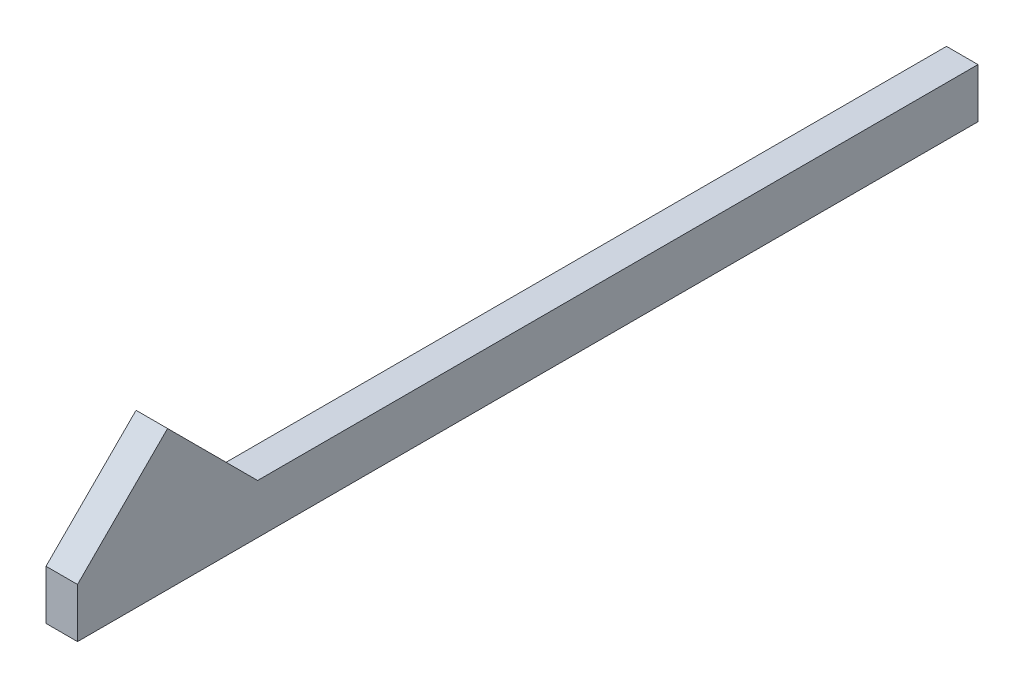
ISO-10303-21;
HEADER;
FILE_DESCRIPTION(('STEP AP214'),'2;1');
FILE_NAME('part.step','',(''),(''),'','','');
FILE_SCHEMA(('AUTOMOTIVE_DESIGN { 1 0 10303 214 1 1 1 1 }'));
ENDSEC;
DATA;
#1=APPLICATION_CONTEXT('core data for automotive mechanical design processes');
#2=APPLICATION_PROTOCOL_DEFINITION('international standard','automotive_design',2000,#1);
#3=PRODUCT_CONTEXT('',#1,'mechanical');
#4=PRODUCT('Part','Part','',(#3));
#5=PRODUCT_RELATED_PRODUCT_CATEGORY('part','',(#4));
#6=PRODUCT_DEFINITION_FORMATION('','',#4);
#7=PRODUCT_DEFINITION_CONTEXT('part definition',#1,'design');
#8=PRODUCT_DEFINITION('design','',#6,#7);
#9=PRODUCT_DEFINITION_SHAPE('','',#8);
#10=(LENGTH_UNIT() NAMED_UNIT(*) SI_UNIT(.MILLI.,.METRE.));
#11=(NAMED_UNIT(*) PLANE_ANGLE_UNIT() SI_UNIT($,.RADIAN.));
#12=(NAMED_UNIT(*) SI_UNIT($,.STERADIAN.) SOLID_ANGLE_UNIT());
#13=UNCERTAINTY_MEASURE_WITH_UNIT(LENGTH_MEASURE(1.E-05),#10,'distance_accuracy_value','');
#14=(GEOMETRIC_REPRESENTATION_CONTEXT(3) GLOBAL_UNCERTAINTY_ASSIGNED_CONTEXT((#13)) GLOBAL_UNIT_ASSIGNED_CONTEXT((#10,
#11,#12)) REPRESENTATION_CONTEXT('',''));
#15=CARTESIAN_POINT('',(0.,0.,0.));
#16=DIRECTION('',(0.,0.,1.));
#17=DIRECTION('',(1.,0.,0.));
#18=AXIS2_PLACEMENT_3D('',#15,#16,#17);
#19=CARTESIAN_POINT('',(0.,0.,-100.));
#20=DIRECTION('',(-1.,0.,0.));
#21=DIRECTION('',(0.,0.,1.));
#22=AXIS2_PLACEMENT_3D('',#19,#20,#21);
#23=PLANE('',#22);
#24=DIRECTION('',(0.,-1.,0.));
#25=VECTOR('',#24,1.);
#26=CARTESIAN_POINT('',(0.,0.,0.));
#27=LINE('',#26,#25);
#28=CARTESIAN_POINT('',(0.,5.5,0.));
#29=VERTEX_POINT('',#28);
#30=CARTESIAN_POINT('',(0.,0.,0.));
#31=VERTEX_POINT('',#30);
#32=EDGE_CURVE('E77',#29,#31,#27,.T.);
#33=ORIENTED_EDGE('',*,*,#32,.F.);
#34=DIRECTION('',(0.,0.707106781186547,-0.707106781186548));
#35=VECTOR('',#34,1.);
#36=CARTESIAN_POINT('',(0.,15.5,-10.));
#37=LINE('',#36,#35);
#38=CARTESIAN_POINT('',(0.,15.5,-10.));
#39=VERTEX_POINT('',#38);
#40=EDGE_CURVE('E116',#29,#39,#37,.T.);
#41=ORIENTED_EDGE('',*,*,#40,.T.);
#42=DIRECTION('',(0.,-0.707106781186547,-0.707106781186548));
#43=VECTOR('',#42,1.);
#44=CARTESIAN_POINT('',(0.,15.5,-10.));
#45=LINE('',#44,#43);
#46=CARTESIAN_POINT('',(0.,5.5,-20.));
#47=VERTEX_POINT('',#46);
#48=EDGE_CURVE('E100',#39,#47,#45,.T.);
#49=ORIENTED_EDGE('',*,*,#48,.T.);
#50=DIRECTION('',(0.,0.,1.));
#51=VECTOR('',#50,1.);
#52=CARTESIAN_POINT('',(0.,5.5,-100.));
#53=LINE('',#52,#51);
#54=CARTESIAN_POINT('',(0.,5.5,-100.));
#55=VERTEX_POINT('',#54);
#56=EDGE_CURVE('E11',#55,#47,#53,.T.);
#57=ORIENTED_EDGE('',*,*,#56,.F.);
#58=DIRECTION('',(0.,-1.,0.));
#59=VECTOR('',#58,1.);
#60=CARTESIAN_POINT('',(0.,0.,-100.));
#61=LINE('',#60,#59);
#62=CARTESIAN_POINT('',(0.,0.,-100.));
#63=VERTEX_POINT('',#62);
#64=EDGE_CURVE('E121',#55,#63,#61,.T.);
#65=ORIENTED_EDGE('',*,*,#64,.T.);
#66=DIRECTION('',(0.,0.,1.));
#67=VECTOR('',#66,1.);
#68=CARTESIAN_POINT('',(0.,0.,-100.));
#69=LINE('',#68,#67);
#70=EDGE_CURVE('E38',#63,#31,#69,.T.);
#71=ORIENTED_EDGE('',*,*,#70,.T.);
#72=EDGE_LOOP('',(#33,#41,#49,#57,#65,#71));
#73=FACE_BOUND('',#72,.T.);
#74=ADVANCED_FACE('F35',(#73),#23,.T.);
#75=CARTESIAN_POINT('',(0.,5.5,-100.));
#76=DIRECTION('',(0.,1.,0.));
#77=DIRECTION('',(0.,0.,1.));
#78=AXIS2_PLACEMENT_3D('',#75,#76,#77);
#79=PLANE('',#78);
#80=DIRECTION('',(-1.,0.,0.));
#81=VECTOR('',#80,1.);
#82=CARTESIAN_POINT('',(3.5,5.5,-20.));
#83=LINE('',#82,#81);
#84=CARTESIAN_POINT('',(3.5,5.5,-20.));
#85=VERTEX_POINT('',#84);
#86=EDGE_CURVE('E50',#85,#47,#83,.T.);
#87=ORIENTED_EDGE('',*,*,#86,.F.);
#88=DIRECTION('',(0.,0.,1.));
#89=VECTOR('',#88,1.);
#90=CARTESIAN_POINT('',(3.5,5.5,-100.));
#91=LINE('',#90,#89);
#92=CARTESIAN_POINT('',(3.5,5.5,-100.));
#93=VERTEX_POINT('',#92);
#94=EDGE_CURVE('E43',#93,#85,#91,.T.);
#95=ORIENTED_EDGE('',*,*,#94,.F.);
#96=DIRECTION('',(-1.,0.,0.));
#97=VECTOR('',#96,1.);
#98=CARTESIAN_POINT('',(0.,5.5,-100.));
#99=LINE('',#98,#97);
#100=EDGE_CURVE('E127',#93,#55,#99,.T.);
#101=ORIENTED_EDGE('',*,*,#100,.T.);
#102=ORIENTED_EDGE('',*,*,#56,.T.);
#103=EDGE_LOOP('',(#87,#95,#101,#102));
#104=FACE_BOUND('',#103,.T.);
#105=ADVANCED_FACE('F145',(#104),#79,.T.);
#106=CARTESIAN_POINT('',(3.5,0.,-100.));
#107=DIRECTION('',(1.,0.,0.));
#108=DIRECTION('',(0.,0.,-1.));
#109=AXIS2_PLACEMENT_3D('',#106,#107,#108);
#110=PLANE('',#109);
#111=DIRECTION('',(0.,1.,0.));
#112=VECTOR('',#111,1.);
#113=CARTESIAN_POINT('',(3.5,0.,0.));
#114=LINE('',#113,#112);
#115=CARTESIAN_POINT('',(3.5,0.,0.));
#116=VERTEX_POINT('',#115);
#117=CARTESIAN_POINT('',(3.5,5.5,0.));
#118=VERTEX_POINT('',#117);
#119=EDGE_CURVE('E134',#116,#118,#114,.T.);
#120=ORIENTED_EDGE('',*,*,#119,.F.);
#121=DIRECTION('',(0.,0.,1.));
#122=VECTOR('',#121,1.);
#123=CARTESIAN_POINT('',(3.5,0.,-100.));
#124=LINE('',#123,#122);
#125=CARTESIAN_POINT('',(3.5,0.,-100.));
#126=VERTEX_POINT('',#125);
#127=EDGE_CURVE('E137',#126,#116,#124,.T.);
#128=ORIENTED_EDGE('',*,*,#127,.F.);
#129=DIRECTION('',(0.,1.,0.));
#130=VECTOR('',#129,1.);
#131=CARTESIAN_POINT('',(3.5,0.,-100.));
#132=LINE('',#131,#130);
#133=EDGE_CURVE('E125',#126,#93,#132,.T.);
#134=ORIENTED_EDGE('',*,*,#133,.T.);
#135=ORIENTED_EDGE('',*,*,#94,.T.);
#136=DIRECTION('',(0.,-0.707106781186547,-0.707106781186548));
#137=VECTOR('',#136,1.);
#138=CARTESIAN_POINT('',(3.5,15.5,-10.));
#139=LINE('',#138,#137);
#140=CARTESIAN_POINT('',(3.5,15.5,-10.));
#141=VERTEX_POINT('',#140);
#142=EDGE_CURVE('E99',#141,#85,#139,.T.);
#143=ORIENTED_EDGE('',*,*,#142,.F.);
#144=DIRECTION('',(0.,0.707106781186547,-0.707106781186548));
#145=VECTOR('',#144,1.);
#146=CARTESIAN_POINT('',(3.5,15.5,-10.));
#147=LINE('',#146,#145);
#148=EDGE_CURVE('E109',#118,#141,#147,.T.);
#149=ORIENTED_EDGE('',*,*,#148,.F.);
#150=EDGE_LOOP('',(#120,#128,#134,#135,#143,#149));
#151=FACE_BOUND('',#150,.T.);
#152=ADVANCED_FACE('F108',(#151),#110,.T.);
#153=CARTESIAN_POINT('',(0.,0.,-100.));
#154=DIRECTION('',(0.,-1.,0.));
#155=DIRECTION('',(0.,0.,-1.));
#156=AXIS2_PLACEMENT_3D('',#153,#154,#155);
#157=PLANE('',#156);
#158=DIRECTION('',(1.,0.,0.));
#159=VECTOR('',#158,1.);
#160=CARTESIAN_POINT('',(0.,0.,0.));
#161=LINE('',#160,#159);
#162=EDGE_CURVE('E131',#31,#116,#161,.T.);
#163=ORIENTED_EDGE('',*,*,#162,.F.);
#164=ORIENTED_EDGE('',*,*,#70,.F.);
#165=DIRECTION('',(1.,0.,0.));
#166=VECTOR('',#165,1.);
#167=CARTESIAN_POINT('',(0.,0.,-100.));
#168=LINE('',#167,#166);
#169=EDGE_CURVE('E123',#63,#126,#168,.T.);
#170=ORIENTED_EDGE('',*,*,#169,.T.);
#171=ORIENTED_EDGE('',*,*,#127,.T.);
#172=EDGE_LOOP('',(#163,#164,#170,#171));
#173=FACE_BOUND('',#172,.T.);
#174=ADVANCED_FACE('F138',(#173),#157,.T.);
#175=CARTESIAN_POINT('',(0.,0.,-100.));
#176=DIRECTION('',(0.,0.,-1.));
#177=DIRECTION('',(-1.,0.,0.));
#178=AXIS2_PLACEMENT_3D('',#175,#176,#177);
#179=PLANE('',#178);
#180=ORIENTED_EDGE('',*,*,#64,.F.);
#181=ORIENTED_EDGE('',*,*,#100,.F.);
#182=ORIENTED_EDGE('',*,*,#133,.F.);
#183=ORIENTED_EDGE('',*,*,#169,.F.);
#184=EDGE_LOOP('',(#180,#181,#182,#183));
#185=FACE_BOUND('',#184,.T.);
#186=ADVANCED_FACE('F144',(#185),#179,.T.);
#187=CARTESIAN_POINT('',(0.,0.,0.));
#188=DIRECTION('',(0.,0.,-1.));
#189=DIRECTION('',(-1.,0.,0.));
#190=AXIS2_PLACEMENT_3D('',#187,#188,#189);
#191=PLANE('',#190);
#192=ORIENTED_EDGE('',*,*,#32,.T.);
#193=ORIENTED_EDGE('',*,*,#162,.T.);
#194=ORIENTED_EDGE('',*,*,#119,.T.);
#195=DIRECTION('',(-1.,0.,0.));
#196=VECTOR('',#195,1.);
#197=CARTESIAN_POINT('',(0.,5.5,0.));
#198=LINE('',#197,#196);
#199=EDGE_CURVE('E114',#118,#29,#198,.T.);
#200=ORIENTED_EDGE('',*,*,#199,.T.);
#201=EDGE_LOOP('',(#192,#193,#194,#200));
#202=FACE_BOUND('',#201,.T.);
#203=ADVANCED_FACE('F140',(#202),#191,.F.);
#204=CARTESIAN_POINT('',(3.5,15.5,-10.));
#205=DIRECTION('',(0.,0.707106781186548,0.707106781186548));
#206=DIRECTION('',(0.,-0.707106781186547,0.707106781186548));
#207=AXIS2_PLACEMENT_3D('',#204,#205,#206);
#208=PLANE('',#207);
#209=ORIENTED_EDGE('',*,*,#40,.F.);
#210=ORIENTED_EDGE('',*,*,#199,.F.);
#211=ORIENTED_EDGE('',*,*,#148,.T.);
#212=DIRECTION('',(-1.,0.,0.));
#213=VECTOR('',#212,1.);
#214=CARTESIAN_POINT('',(3.5,15.5,-10.));
#215=LINE('',#214,#213);
#216=EDGE_CURVE('E96',#141,#39,#215,.T.);
#217=ORIENTED_EDGE('',*,*,#216,.T.);
#218=EDGE_LOOP('',(#209,#210,#211,#217));
#219=FACE_BOUND('',#218,.T.);
#220=ADVANCED_FACE('F113',(#219),#208,.T.);
#221=CARTESIAN_POINT('',(3.5,15.5,-10.));
#222=DIRECTION('',(0.,0.707106781186548,-0.707106781186548));
#223=DIRECTION('',(0.,0.707106781186547,0.707106781186548));
#224=AXIS2_PLACEMENT_3D('',#221,#222,#223);
#225=PLANE('',#224);
#226=ORIENTED_EDGE('',*,*,#48,.F.);
#227=ORIENTED_EDGE('',*,*,#216,.F.);
#228=ORIENTED_EDGE('',*,*,#142,.T.);
#229=ORIENTED_EDGE('',*,*,#86,.T.);
#230=EDGE_LOOP('',(#226,#227,#228,#229));
#231=FACE_BOUND('',#230,.T.);
#232=ADVANCED_FACE('F98',(#231),#225,.T.);
#233=CLOSED_SHELL('',(#74,#105,#152,#174,#186,#203,#220,#232));
#234=MANIFOLD_SOLID_BREP('B2',#233);
#235=ADVANCED_BREP_SHAPE_REPRESENTATION('',(#18,#234),#14);
#236=SHAPE_DEFINITION_REPRESENTATION(#9,#235);
ENDSEC;
END-ISO-10303-21;
